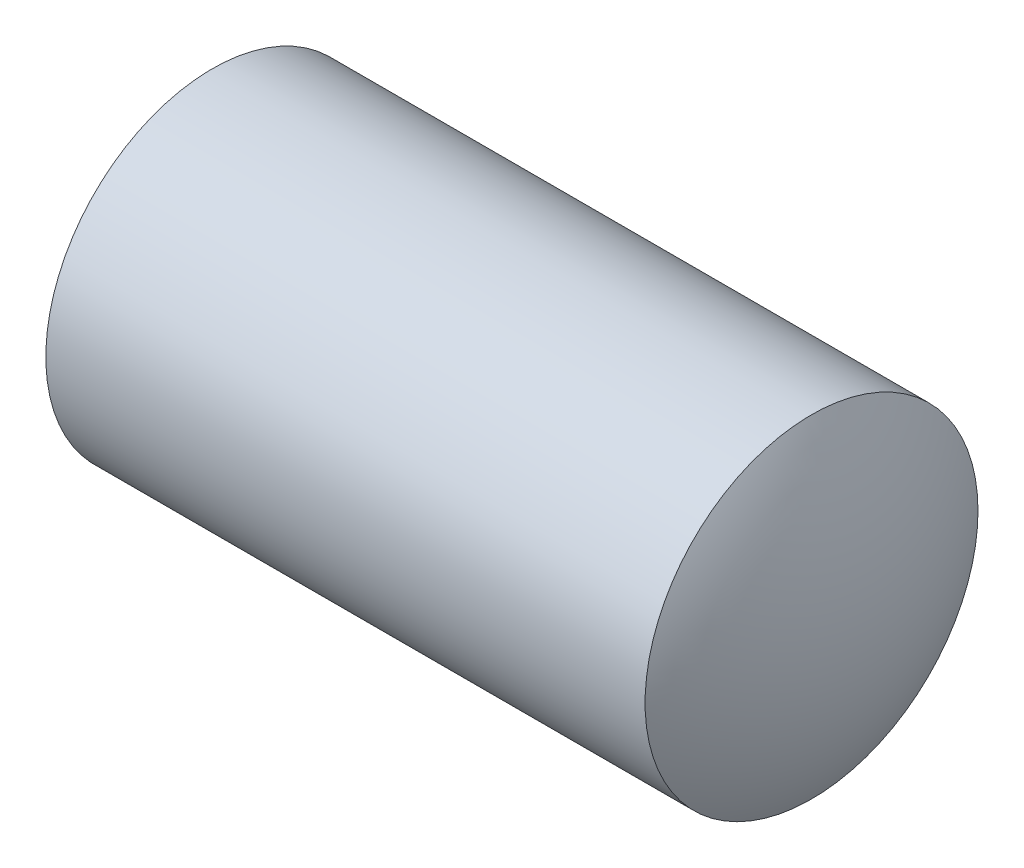
ISO-10303-21;
HEADER;
FILE_DESCRIPTION(('STEP AP214'),'2;1');
FILE_NAME('part.step','',(''),(''),'','','');
FILE_SCHEMA(('AUTOMOTIVE_DESIGN { 1 0 10303 214 1 1 1 1 }'));
ENDSEC;
DATA;
#1=APPLICATION_CONTEXT('core data for automotive mechanical design processes');
#2=APPLICATION_PROTOCOL_DEFINITION('international standard','automotive_design',2000,#1);
#3=PRODUCT_CONTEXT('',#1,'mechanical');
#4=PRODUCT('Part','Part','',(#3));
#5=PRODUCT_RELATED_PRODUCT_CATEGORY('part','',(#4));
#6=PRODUCT_DEFINITION_FORMATION('','',#4);
#7=PRODUCT_DEFINITION_CONTEXT('part definition',#1,'design');
#8=PRODUCT_DEFINITION('design','',#6,#7);
#9=PRODUCT_DEFINITION_SHAPE('','',#8);
#10=(LENGTH_UNIT() NAMED_UNIT(*) SI_UNIT(.MILLI.,.METRE.));
#11=(NAMED_UNIT(*) PLANE_ANGLE_UNIT() SI_UNIT($,.RADIAN.));
#12=(NAMED_UNIT(*) SI_UNIT($,.STERADIAN.) SOLID_ANGLE_UNIT());
#13=UNCERTAINTY_MEASURE_WITH_UNIT(LENGTH_MEASURE(1.E-05),#10,'distance_accuracy_value','');
#14=(GEOMETRIC_REPRESENTATION_CONTEXT(3) GLOBAL_UNCERTAINTY_ASSIGNED_CONTEXT((#13)) GLOBAL_UNIT_ASSIGNED_CONTEXT((#10,
#11,#12)) REPRESENTATION_CONTEXT('',''));
#15=CARTESIAN_POINT('',(0.,0.,0.));
#16=DIRECTION('',(0.,0.,1.));
#17=DIRECTION('',(1.,0.,0.));
#18=AXIS2_PLACEMENT_3D('',#15,#16,#17);
#19=CARTESIAN_POINT('',(27.6019237886467,0.,0.9));
#20=DIRECTION('',(0.,-1.,0.));
#21=DIRECTION('',(1.,0.,0.));
#22=AXIS2_PLACEMENT_3D('',#19,#20,#21);
#23=SPHERICAL_SURFACE('',#22,3.);
#24=CARTESIAN_POINT('',(27.6019237886467,0.,0.9));
#25=DIRECTION('',(-1.,0.,0.));
#26=DIRECTION('',(0.,0.,-1.));
#27=AXIS2_PLACEMENT_3D('',#24,#25,#26);
#28=SPHERICAL_SURFACE('',#27,3.);
#29=CARTESIAN_POINT('',(30.2,0.,0.9));
#30=DIRECTION('',(-1.,0.,0.));
#31=DIRECTION('',(0.,0.,-1.));
#32=AXIS2_PLACEMENT_3D('',#29,#30,#31);
#33=CIRCLE('',#32,1.5);
#34=CARTESIAN_POINT('',(30.2,0.,-0.6));
#35=VERTEX_POINT('',#34);
#36=EDGE_CURVE('E11',#35,#35,#33,.T.);
#37=ORIENTED_EDGE('',*,*,#36,.F.);
#38=EDGE_LOOP('',(#37));
#39=FACE_BOUND('',#38,.T.);
#40=ADVANCED_FACE('F17',(#39),#28,.T.);
#41=CARTESIAN_POINT('',(27.3980762113533,0.,0.9));
#42=DIRECTION('',(0.,-1.,0.));
#43=DIRECTION('',(-1.,0.,0.));
#44=AXIS2_PLACEMENT_3D('',#41,#42,#43);
#45=SPHERICAL_SURFACE('',#44,3.);
#46=CARTESIAN_POINT('',(27.3980762113533,0.,0.9));
#47=DIRECTION('',(-1.,0.,0.));
#48=DIRECTION('',(0.,0.,-1.));
#49=AXIS2_PLACEMENT_3D('',#46,#47,#48);
#50=SPHERICAL_SURFACE('',#49,3.);
#51=CARTESIAN_POINT('',(24.8,0.,0.9));
#52=DIRECTION('',(-1.,0.,0.));
#53=DIRECTION('',(0.,0.,-1.));
#54=AXIS2_PLACEMENT_3D('',#51,#52,#53);
#55=CIRCLE('',#54,1.5);
#56=CARTESIAN_POINT('',(24.8,0.,-0.6));
#57=VERTEX_POINT('',#56);
#58=EDGE_CURVE('E25',#57,#57,#55,.T.);
#59=ORIENTED_EDGE('',*,*,#58,.T.);
#60=EDGE_LOOP('',(#59));
#61=FACE_BOUND('',#60,.T.);
#62=ADVANCED_FACE('F39',(#61),#50,.T.);
#63=CARTESIAN_POINT('',(26.15,0.,0.9));
#64=DIRECTION('',(-1.,0.,0.));
#65=DIRECTION('',(0.,0.,-1.));
#66=AXIS2_PLACEMENT_3D('',#63,#64,#65);
#67=CYLINDRICAL_SURFACE('',#66,1.5);
#68=ORIENTED_EDGE('',*,*,#36,.T.);
#69=EDGE_LOOP('',(#68));
#70=FACE_BOUND('',#69,.T.);
#71=ORIENTED_EDGE('',*,*,#58,.F.);
#72=EDGE_LOOP('',(#71));
#73=FACE_BOUND('',#72,.T.);
#74=ADVANCED_FACE('F47',(#70,#73),#67,.T.);
#75=CLOSED_SHELL('',(#40,#62,#74));
#76=MANIFOLD_SOLID_BREP('B1',#75);
#77=ADVANCED_BREP_SHAPE_REPRESENTATION('',(#18,#76),#14);
#78=SHAPE_DEFINITION_REPRESENTATION(#9,#77);
ENDSEC;
END-ISO-10303-21;
